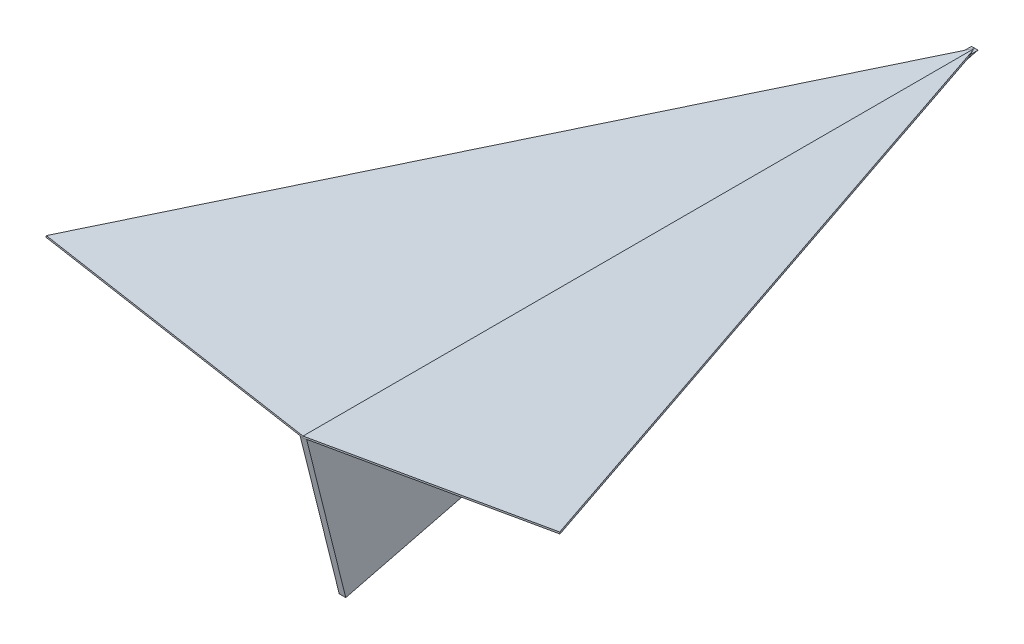
ISO-10303-21;
HEADER;
FILE_DESCRIPTION(('STEP AP214'),'2;1');
FILE_NAME('part.step','',(''),(''),'','','');
FILE_SCHEMA(('AUTOMOTIVE_DESIGN { 1 0 10303 214 1 1 1 1 }'));
ENDSEC;
DATA;
#1=APPLICATION_CONTEXT('core data for automotive mechanical design processes');
#2=APPLICATION_PROTOCOL_DEFINITION('international standard','automotive_design',2000,#1);
#3=PRODUCT_CONTEXT('',#1,'mechanical');
#4=PRODUCT('Part','Part','',(#3));
#5=PRODUCT_RELATED_PRODUCT_CATEGORY('part','',(#4));
#6=PRODUCT_DEFINITION_FORMATION('','',#4);
#7=PRODUCT_DEFINITION_CONTEXT('part definition',#1,'design');
#8=PRODUCT_DEFINITION('design','',#6,#7);
#9=PRODUCT_DEFINITION_SHAPE('','',#8);
#10=(LENGTH_UNIT() NAMED_UNIT(*) SI_UNIT(.MILLI.,.METRE.));
#11=(NAMED_UNIT(*) PLANE_ANGLE_UNIT() SI_UNIT($,.RADIAN.));
#12=(NAMED_UNIT(*) SI_UNIT($,.STERADIAN.) SOLID_ANGLE_UNIT());
#13=UNCERTAINTY_MEASURE_WITH_UNIT(LENGTH_MEASURE(1.E-05),#10,'distance_accuracy_value','');
#14=(GEOMETRIC_REPRESENTATION_CONTEXT(3) GLOBAL_UNCERTAINTY_ASSIGNED_CONTEXT((#13)) GLOBAL_UNIT_ASSIGNED_CONTEXT((#10,
#11,#12)) REPRESENTATION_CONTEXT('',''));
#15=CARTESIAN_POINT('',(0.,0.,0.));
#16=DIRECTION('',(0.,0.,1.));
#17=DIRECTION('',(1.,0.,0.));
#18=AXIS2_PLACEMENT_3D('',#15,#16,#17);
#19=CARTESIAN_POINT('',(0.,0.,0.));
#20=DIRECTION('',(-0.984807753012209,0.173648177666927,0.));
#21=DIRECTION('',(0.,0.,-1.));
#22=AXIS2_PLACEMENT_3D('',#19,#20,#21);
#23=PLANE('',#22);
#24=DIRECTION('',(-0.168613082024781,-0.95625230663687,-0.239063076659216));
#25=VECTOR('',#24,1.);
#26=CARTESIAN_POINT('',(-8.30994666202101,-47.1280494263135,194.373268924305));
#27=LINE('',#26,#25);
#28=CARTESIAN_POINT('',(0.,0.,206.155281280883));
#29=VERTEX_POINT('',#28);
#30=CARTESIAN_POINT('',(-0.0868240888334648,-0.492403876506104,206.032180311757));
#31=VERTEX_POINT('',#30);
#32=EDGE_CURVE('E218',#29,#31,#27,.T.);
#33=ORIENTED_EDGE('',*,*,#32,.F.);
#34=DIRECTION('',(0.173648177666927,0.984807753012209,0.));
#35=VECTOR('',#34,1.);
#36=CARTESIAN_POINT('',(0.,0.,206.155281280883));
#37=LINE('',#36,#35);
#38=CARTESIAN_POINT('',(-0.0868240888334637,-0.492403876506104,206.155281280883));
#39=VERTEX_POINT('',#38);
#40=EDGE_CURVE('E243',#39,#29,#37,.T.);
#41=ORIENTED_EDGE('',*,*,#40,.F.);
#42=DIRECTION('',(0.,0.,1.));
#43=VECTOR('',#42,1.);
#44=CARTESIAN_POINT('',(-0.0868240888334637,-0.492403876506104,0.));
#45=LINE('',#44,#43);
#46=EDGE_CURVE('E234',#39,#31,#45,.F.);
#47=ORIENTED_EDGE('',*,*,#46,.T.);
#48=EDGE_LOOP('',(#33,#41,#47));
#49=FACE_BOUND('',#48,.T.);
#50=ADVANCED_FACE('F41',(#49),#23,.F.);
#51=CARTESIAN_POINT('',(0.,0.,206.155281280883));
#52=DIRECTION('',(0.,0.,-1.));
#53=DIRECTION('',(0.984807753012209,-0.173648177666927,0.));
#54=AXIS2_PLACEMENT_3D('',#51,#52,#53);
#55=PLANE('',#54);
#56=DIRECTION('',(0.173648177666927,0.984807753012209,0.));
#57=VECTOR('',#56,1.);
#58=CARTESIAN_POINT('',(-78.7846202409767,13.8918542133542,206.155281280883));
#59=LINE('',#58,#57);
#60=CARTESIAN_POINT('',(-78.8714443298102,13.3994503368481,206.155281280883));
#61=VERTEX_POINT('',#60);
#62=CARTESIAN_POINT('',(-78.7846202409767,13.8918542133542,206.155281280883));
#63=VERTEX_POINT('',#62);
#64=EDGE_CURVE('E246',#61,#63,#59,.T.);
#65=ORIENTED_EDGE('',*,*,#64,.F.);
#66=DIRECTION('',(0.984807753012209,-0.173648177666927,0.));
#67=VECTOR('',#66,1.);
#68=CARTESIAN_POINT('',(-0.0868240888334637,-0.492403876506104,206.155281280883));
#69=LINE('',#68,#67);
#70=EDGE_CURVE('E227',#61,#39,#69,.T.);
#71=ORIENTED_EDGE('',*,*,#70,.T.);
#72=ORIENTED_EDGE('',*,*,#40,.T.);
#73=DIRECTION('',(0.984807753012209,-0.173648177666927,0.));
#74=VECTOR('',#73,1.);
#75=CARTESIAN_POINT('',(0.,0.,206.155281280883));
#76=LINE('',#75,#74);
#77=EDGE_CURVE('E230',#63,#29,#76,.T.);
#78=ORIENTED_EDGE('',*,*,#77,.F.);
#79=EDGE_LOOP('',(#65,#71,#72,#78));
#80=FACE_BOUND('',#79,.T.);
#81=ADVANCED_FACE('F299',(#80),#55,.F.);
#82=CARTESIAN_POINT('',(-78.7846202409767,13.8918542133542,206.155281280883));
#83=DIRECTION('',(0.918103185896323,-0.161886362747918,0.361772505316908));
#84=DIRECTION('',(-0.356276368062741,0.0628211362782798,0.932266407416211));
#85=AXIS2_PLACEMENT_3D('',#82,#83,#84);
#86=PLANE('',#85);
#87=DIRECTION('',(0.366608286043351,0.,-0.930375389079245));
#88=VECTOR('',#87,1.);
#89=CARTESIAN_POINT('',(-80.9049109743354,0.,205.319794701171));
#90=LINE('',#89,#88);
#91=CARTESIAN_POINT('',(-1.,0.,2.53779149162283));
#92=VERTEX_POINT('',#91);
#93=CARTESIAN_POINT('',(0.,0.,0.));
#94=VERTEX_POINT('',#93);
#95=EDGE_CURVE('E221',#92,#94,#90,.T.);
#96=ORIENTED_EDGE('',*,*,#95,.F.);
#97=DIRECTION('',(0.,-0.912779904818423,-0.408451766258478));
#98=VECTOR('',#97,1.);
#99=CARTESIAN_POINT('',(-1.,87.4882458029073,41.6871289566736));
#100=LINE('',#99,#98);
#101=CARTESIAN_POINT('',(-0.999999999999903,-0.331386325234429,2.38950237050844));
#102=VERTEX_POINT('',#101);
#103=EDGE_CURVE('E206',#102,#92,#100,.F.);
#104=ORIENTED_EDGE('',*,*,#103,.F.);
#105=DIRECTION('',(-0.356276368062741,0.0628211362782798,0.932266407416211));
#106=VECTOR('',#105,1.);
#107=CARTESIAN_POINT('',(-78.8714443298102,13.3994503368481,206.155281280883));
#108=LINE('',#107,#106);
#109=EDGE_CURVE('E237',#102,#61,#108,.T.);
#110=ORIENTED_EDGE('',*,*,#109,.T.);
#111=ORIENTED_EDGE('',*,*,#64,.T.);
#112=DIRECTION('',(-0.356276368062741,0.0628211362782798,0.932266407416211));
#113=VECTOR('',#112,1.);
#114=CARTESIAN_POINT('',(-78.7846202409767,13.8918542133542,206.155281280883));
#115=LINE('',#114,#113);
#116=EDGE_CURVE('E226',#94,#63,#115,.T.);
#117=ORIENTED_EDGE('',*,*,#116,.F.);
#118=EDGE_LOOP('',(#96,#104,#110,#111,#117));
#119=FACE_BOUND('',#118,.T.);
#120=ADVANCED_FACE('F43',(#119),#86,.F.);
#121=CARTESIAN_POINT('',(0.,0.,0.));
#122=DIRECTION('',(-0.173648177666927,-0.984807753012209,0.));
#123=DIRECTION('',(0.984807753012209,-0.173648177666927,0.));
#124=AXIS2_PLACEMENT_3D('',#121,#122,#123);
#125=PLANE('',#124);
#126=DIRECTION('',(0.,0.,-1.));
#127=VECTOR('',#126,1.);
#128=CARTESIAN_POINT('',(0.,0.,0.));
#129=LINE('',#128,#127);
#130=EDGE_CURVE('E156',#29,#94,#129,.T.);
#131=ORIENTED_EDGE('',*,*,#130,.T.);
#132=ORIENTED_EDGE('',*,*,#116,.T.);
#133=ORIENTED_EDGE('',*,*,#77,.T.);
#134=EDGE_LOOP('',(#131,#132,#133));
#135=FACE_BOUND('',#134,.T.);
#136=ADVANCED_FACE('F281',(#135),#125,.F.);
#137=CARTESIAN_POINT('',(-0.0868240888334637,-0.492403876506104,0.));
#138=DIRECTION('',(-0.173648177666927,-0.984807753012209,0.));
#139=DIRECTION('',(0.984807753012209,-0.173648177666927,0.));
#140=AXIS2_PLACEMENT_3D('',#137,#138,#139);
#141=PLANE('',#140);
#142=DIRECTION('',(0.983881075519547,-0.173484779422556,-0.0433711948556388));
#143=VECTOR('',#142,1.);
#144=CARTESIAN_POINT('',(8.70500126785192,-2.04263989656653,205.644621306741));
#145=LINE('',#144,#143);
#146=CARTESIAN_POINT('',(-1.,-0.331386325234416,206.072434699574));
#147=VERTEX_POINT('',#146);
#148=EDGE_CURVE('E253',#31,#147,#145,.F.);
#149=ORIENTED_EDGE('',*,*,#148,.F.);
#150=ORIENTED_EDGE('',*,*,#46,.F.);
#151=ORIENTED_EDGE('',*,*,#70,.F.);
#152=ORIENTED_EDGE('',*,*,#109,.F.);
#153=DIRECTION('',(0.,0.,-1.));
#154=VECTOR('',#153,1.);
#155=CARTESIAN_POINT('',(-1.,-0.33138632523441,0.));
#156=LINE('',#155,#154);
#157=EDGE_CURVE('E248',#147,#102,#156,.T.);
#158=ORIENTED_EDGE('',*,*,#157,.F.);
#159=EDGE_LOOP('',(#149,#150,#151,#152,#158));
#160=FACE_BOUND('',#159,.T.);
#161=ADVANCED_FACE('F301',(#160),#141,.T.);
#162=CARTESIAN_POINT('',(0.,0.,0.));
#163=DIRECTION('',(0.,-1.,0.));
#164=DIRECTION('',(0.,0.,1.));
#165=AXIS2_PLACEMENT_3D('',#162,#163,#164);
#166=PLANE('',#165);
#167=DIRECTION('',(0.366608286043352,0.,0.930375389079245));
#168=VECTOR('',#167,1.);
#169=CARTESIAN_POINT('',(0.,0.,0.));
#170=LINE('',#169,#168);
#171=CARTESIAN_POINT('',(1.,0.,2.53779149162285));
#172=VERTEX_POINT('',#171);
#173=EDGE_CURVE('E162',#172,#94,#170,.F.);
#174=ORIENTED_EDGE('',*,*,#173,.F.);
#175=DIRECTION('',(0.,0.,1.));
#176=VECTOR('',#175,1.);
#177=CARTESIAN_POINT('',(1.,0.,0.));
#178=LINE('',#177,#176);
#179=CARTESIAN_POINT('',(1.,0.,0.));
#180=VERTEX_POINT('',#179);
#181=EDGE_CURVE('E190',#180,#172,#178,.T.);
#182=ORIENTED_EDGE('',*,*,#181,.F.);
#183=DIRECTION('',(1.,0.,0.));
#184=VECTOR('',#183,1.);
#185=CARTESIAN_POINT('',(0.,0.,0.));
#186=LINE('',#185,#184);
#187=EDGE_CURVE('E194',#94,#180,#186,.T.);
#188=ORIENTED_EDGE('',*,*,#187,.F.);
#189=EDGE_LOOP('',(#174,#182,#188));
#190=FACE_BOUND('',#189,.T.);
#191=ADVANCED_FACE('F268',(#190),#166,.F.);
#192=CARTESIAN_POINT('',(0.,0.,206.155281280883));
#193=DIRECTION('',(0.,0.242535625036332,-0.970142500145332));
#194=DIRECTION('',(0.,-0.970142500145332,-0.242535625036332));
#195=AXIS2_PLACEMENT_3D('',#192,#193,#194);
#196=PLANE('',#195);
#197=DIRECTION('',(-0.168613082024788,0.956252306636869,0.239063076659216));
#198=VECTOR('',#197,1.);
#199=CARTESIAN_POINT('',(0.,0.,206.155281280883));
#200=LINE('',#199,#198);
#201=CARTESIAN_POINT('',(0.086824088833467,-0.492403876506104,206.032180311757));
#202=VERTEX_POINT('',#201);
#203=EDGE_CURVE('E177',#29,#202,#200,.F.);
#204=ORIENTED_EDGE('',*,*,#203,.F.);
#205=ORIENTED_EDGE('',*,*,#32,.T.);
#206=ORIENTED_EDGE('',*,*,#148,.T.);
#207=DIRECTION('',(0.,-0.970142500145332,-0.242535625036332));
#208=VECTOR('',#207,1.);
#209=CARTESIAN_POINT('',(-1.,0.,206.155281280883));
#210=LINE('',#209,#208);
#211=CARTESIAN_POINT('',(-1.,-48.5071250072666,194.028500029066));
#212=VERTEX_POINT('',#211);
#213=EDGE_CURVE('E191',#147,#212,#210,.T.);
#214=ORIENTED_EDGE('',*,*,#213,.T.);
#215=DIRECTION('',(1.,0.,0.));
#216=VECTOR('',#215,1.);
#217=CARTESIAN_POINT('',(0.,-48.5071250072666,194.028500029066));
#218=LINE('',#217,#216);
#219=CARTESIAN_POINT('',(1.,-48.5071250072666,194.028500029066));
#220=VERTEX_POINT('',#219);
#221=EDGE_CURVE('E203',#212,#220,#218,.T.);
#222=ORIENTED_EDGE('',*,*,#221,.T.);
#223=DIRECTION('',(0.,-0.970142500145332,-0.242535625036332));
#224=VECTOR('',#223,1.);
#225=CARTESIAN_POINT('',(1.,0.,206.155281280883));
#226=LINE('',#225,#224);
#227=CARTESIAN_POINT('',(1.,-0.331386325234406,206.072434699574));
#228=VERTEX_POINT('',#227);
#229=EDGE_CURVE('E192',#228,#220,#226,.T.);
#230=ORIENTED_EDGE('',*,*,#229,.F.);
#231=DIRECTION('',(0.983881075519546,0.173484779422562,0.0433711948556404));
#232=VECTOR('',#231,1.);
#233=CARTESIAN_POINT('',(0.0920770654323727,-0.491477635002686,206.032411872132));
#234=LINE('',#233,#232);
#235=EDGE_CURVE('E64',#228,#202,#234,.F.);
#236=ORIENTED_EDGE('',*,*,#235,.T.);
#237=EDGE_LOOP('',(#204,#205,#206,#214,#222,#230,#236));
#238=FACE_BOUND('',#237,.T.);
#239=ADVANCED_FACE('F304',(#238),#196,.F.);
#240=CARTESIAN_POINT('',(0.,-48.5071250072666,194.028500029066));
#241=DIRECTION('',(0.,0.970142500145332,0.242535625036333));
#242=DIRECTION('',(0.,0.242535625036333,-0.970142500145332));
#243=AXIS2_PLACEMENT_3D('',#240,#241,#242);
#244=PLANE('',#243);
#245=DIRECTION('',(-0.391174804997672,0.2232095127552,-0.892838051020799));
#246=VECTOR('',#245,1.);
#247=CARTESIAN_POINT('',(72.0009174838218,-41.0846749436913,164.338699774765));
#248=LINE('',#247,#246);
#249=CARTESIAN_POINT('',(0.679724172658984,-0.387859594863354,1.55143837945337));
#250=VERTEX_POINT('',#249);
#251=EDGE_CURVE('E184',#94,#250,#248,.F.);
#252=ORIENTED_EDGE('',*,*,#251,.F.);
#253=ORIENTED_EDGE('',*,*,#187,.T.);
#254=DIRECTION('',(0.,0.242535625036333,-0.970142500145332));
#255=VECTOR('',#254,1.);
#256=CARTESIAN_POINT('',(1.,-48.5071250072666,194.028500029066));
#257=LINE('',#256,#255);
#258=EDGE_CURVE('E187',#220,#180,#257,.T.);
#259=ORIENTED_EDGE('',*,*,#258,.F.);
#260=ORIENTED_EDGE('',*,*,#221,.F.);
#261=DIRECTION('',(0.,0.242535625036333,-0.970142500145332));
#262=VECTOR('',#261,1.);
#263=CARTESIAN_POINT('',(-1.,-48.5071250072666,194.028500029066));
#264=LINE('',#263,#262);
#265=CARTESIAN_POINT('',(-1.,0.,0.));
#266=VERTEX_POINT('',#265);
#267=EDGE_CURVE('E186',#212,#266,#264,.T.);
#268=ORIENTED_EDGE('',*,*,#267,.T.);
#269=EDGE_CURVE('E207',#266,#94,#186,.T.);
#270=ORIENTED_EDGE('',*,*,#269,.T.);
#271=DIRECTION('',(-0.391174804997671,-0.2232095127552,0.8928380510208));
#272=VECTOR('',#271,1.);
#273=CARTESIAN_POINT('',(-82.8434085872676,-47.2715436410943,189.086174564377));
#274=LINE('',#273,#272);
#275=CARTESIAN_POINT('',(-0.679724172659017,-0.387859594863353,1.55143837945339));
#276=VERTEX_POINT('',#275);
#277=EDGE_CURVE('E212',#94,#276,#274,.T.);
#278=ORIENTED_EDGE('',*,*,#277,.T.);
#279=DIRECTION('',(-0.808835321616389,0.142619490150976,-0.570477960603903));
#280=VECTOR('',#279,1.);
#281=CARTESIAN_POINT('',(-0.995649442313647,-0.332153445935643,1.32861378374259));
#282=LINE('',#281,#280);
#283=CARTESIAN_POINT('',(-0.0868240888334637,-0.492403876506104,1.96961550602443));
#284=VERTEX_POINT('',#283);
#285=EDGE_CURVE('E256',#276,#284,#282,.F.);
#286=ORIENTED_EDGE('',*,*,#285,.T.);
#287=DIRECTION('',(0.0427265211780192,0.242314142772416,-0.969256571089664));
#288=VECTOR('',#287,1.);
#289=CARTESIAN_POINT('',(0.,0.,0.));
#290=LINE('',#289,#288);
#291=EDGE_CURVE('E215',#284,#94,#290,.T.);
#292=ORIENTED_EDGE('',*,*,#291,.T.);
#293=DIRECTION('',(0.0427265211780209,-0.242314142772416,0.969256571089664));
#294=VECTOR('',#293,1.);
#295=CARTESIAN_POINT('',(8.53750070848244,-48.4185725529888,193.674290211955));
#296=LINE('',#295,#294);
#297=CARTESIAN_POINT('',(0.0868240888334534,-0.492403876506108,1.96961550602446));
#298=VERTEX_POINT('',#297);
#299=EDGE_CURVE('E148',#298,#94,#296,.F.);
#300=ORIENTED_EDGE('',*,*,#299,.F.);
#301=DIRECTION('',(-0.808835321616378,-0.142619490150979,0.570477960603917));
#302=VECTOR('',#301,1.);
#303=CARTESIAN_POINT('',(-94.1290821658783,-17.1052101611116,68.4208406444463));
#304=LINE('',#303,#302);
#305=EDGE_CURVE('E180',#298,#250,#304,.F.);
#306=ORIENTED_EDGE('',*,*,#305,.T.);
#307=EDGE_LOOP('',(#252,#253,#259,#260,#268,#270,#278,#286,#292,#300,#306));
#308=FACE_BOUND('',#307,.T.);
#309=ADVANCED_FACE('F287',(#308),#244,.F.);
#310=DIRECTION('',(0.,0.,1.));
#311=VECTOR('',#310,1.);
#312=CARTESIAN_POINT('',(-1.,0.,0.));
#313=LINE('',#312,#311);
#314=EDGE_CURVE('E199',#266,#92,#313,.T.);
#315=ORIENTED_EDGE('',*,*,#314,.T.);
#316=ORIENTED_EDGE('',*,*,#95,.T.);
#317=ORIENTED_EDGE('',*,*,#269,.F.);
#318=EDGE_LOOP('',(#315,#316,#317));
#319=FACE_BOUND('',#318,.T.);
#320=ADVANCED_FACE('F289',(#319),#166,.F.);
#321=CARTESIAN_POINT('',(1.,0.,0.));
#322=DIRECTION('',(-1.,0.,0.));
#323=DIRECTION('',(0.,0.,1.));
#324=AXIS2_PLACEMENT_3D('',#321,#322,#323);
#325=PLANE('',#324);
#326=ORIENTED_EDGE('',*,*,#181,.T.);
#327=DIRECTION('',(0.,-0.912779904818418,-0.408451766258491));
#328=VECTOR('',#327,1.);
#329=CARTESIAN_POINT('',(1.,-0.946156082803438,2.11440451614582));
#330=LINE('',#329,#328);
#331=CARTESIAN_POINT('',(0.999999999999994,-0.331386325234404,2.38950237050897));
#332=VERTEX_POINT('',#331);
#333=EDGE_CURVE('E11',#172,#332,#330,.T.);
#334=ORIENTED_EDGE('',*,*,#333,.T.);
#335=DIRECTION('',(0.,0.,-1.));
#336=VECTOR('',#335,1.);
#337=CARTESIAN_POINT('',(1.,-0.331386325234404,0.));
#338=LINE('',#337,#336);
#339=EDGE_CURVE('E49',#228,#332,#338,.T.);
#340=ORIENTED_EDGE('',*,*,#339,.F.);
#341=ORIENTED_EDGE('',*,*,#229,.T.);
#342=ORIENTED_EDGE('',*,*,#258,.T.);
#343=EDGE_LOOP('',(#326,#334,#340,#341,#342));
#344=FACE_BOUND('',#343,.T.);
#345=ADVANCED_FACE('F263',(#344),#325,.F.);
#346=CARTESIAN_POINT('',(-1.,0.,0.));
#347=DIRECTION('',(-1.,0.,0.));
#348=DIRECTION('',(0.,0.,1.));
#349=AXIS2_PLACEMENT_3D('',#346,#347,#348);
#350=PLANE('',#349);
#351=ORIENTED_EDGE('',*,*,#157,.T.);
#352=ORIENTED_EDGE('',*,*,#103,.T.);
#353=ORIENTED_EDGE('',*,*,#314,.F.);
#354=ORIENTED_EDGE('',*,*,#267,.F.);
#355=ORIENTED_EDGE('',*,*,#213,.F.);
#356=EDGE_LOOP('',(#351,#352,#353,#354,#355));
#357=FACE_BOUND('',#356,.T.);
#358=ADVANCED_FACE('F295',(#357),#350,.T.);
#359=ORIENTED_EDGE('',*,*,#285,.F.);
#360=CARTESIAN_POINT('',(-0.0868240888334637,-0.492403876506104,0.));
#361=VERTEX_POINT('',#360);
#362=EDGE_CURVE('E240',#361,#276,#108,.T.);
#363=ORIENTED_EDGE('',*,*,#362,.F.);
#364=EDGE_CURVE('E224',#284,#361,#45,.F.);
#365=ORIENTED_EDGE('',*,*,#364,.F.);
#366=EDGE_LOOP('',(#359,#363,#365));
#367=FACE_BOUND('',#366,.T.);
#368=ADVANCED_FACE('F331',(#367),#141,.T.);
#369=ORIENTED_EDGE('',*,*,#277,.F.);
#370=DIRECTION('',(0.173648177666927,0.984807753012209,0.));
#371=VECTOR('',#370,1.);
#372=CARTESIAN_POINT('',(0.,0.,0.));
#373=LINE('',#372,#371);
#374=EDGE_CURVE('E233',#361,#94,#373,.T.);
#375=ORIENTED_EDGE('',*,*,#374,.F.);
#376=ORIENTED_EDGE('',*,*,#362,.T.);
#377=EDGE_LOOP('',(#369,#375,#376));
#378=FACE_BOUND('',#377,.T.);
#379=ADVANCED_FACE('F274',(#378),#86,.F.);
#380=ORIENTED_EDGE('',*,*,#291,.F.);
#381=ORIENTED_EDGE('',*,*,#364,.T.);
#382=ORIENTED_EDGE('',*,*,#374,.T.);
#383=EDGE_LOOP('',(#380,#381,#382));
#384=FACE_BOUND('',#383,.T.);
#385=ADVANCED_FACE('F277',(#384),#23,.F.);
#386=CARTESIAN_POINT('',(0.086824088833467,-0.492403876506104,0.));
#387=DIRECTION('',(-0.173648177666934,0.984807753012208,0.));
#388=DIRECTION('',(-0.984807753012208,-0.173648177666934,0.));
#389=AXIS2_PLACEMENT_3D('',#386,#387,#388);
#390=PLANE('',#389);
#391=ORIENTED_EDGE('',*,*,#235,.F.);
#392=ORIENTED_EDGE('',*,*,#339,.T.);
#393=DIRECTION('',(-0.356276368062741,-0.0628211362782822,-0.932266407416211));
#394=VECTOR('',#393,1.);
#395=CARTESIAN_POINT('',(78.8714443298101,13.3994503368486,206.155281280883));
#396=LINE('',#395,#394);
#397=CARTESIAN_POINT('',(78.8714443298101,13.3994503368486,206.155281280883));
#398=VERTEX_POINT('',#397);
#399=EDGE_CURVE('E157',#398,#332,#396,.T.);
#400=ORIENTED_EDGE('',*,*,#399,.F.);
#401=DIRECTION('',(-0.984807753012208,-0.173648177666934,0.));
#402=VECTOR('',#401,1.);
#403=CARTESIAN_POINT('',(0.086824088833467,-0.492403876506104,206.155281280883));
#404=LINE('',#403,#402);
#405=CARTESIAN_POINT('',(0.086824088833467,-0.492403876506104,206.155281280883));
#406=VERTEX_POINT('',#405);
#407=EDGE_CURVE('E143',#406,#398,#404,.F.);
#408=ORIENTED_EDGE('',*,*,#407,.F.);
#409=DIRECTION('',(0.,0.,1.));
#410=VECTOR('',#409,1.);
#411=CARTESIAN_POINT('',(0.086824088833467,-0.492403876506104,0.));
#412=LINE('',#411,#410);
#413=EDGE_CURVE('E171',#202,#406,#412,.T.);
#414=ORIENTED_EDGE('',*,*,#413,.F.);
#415=EDGE_LOOP('',(#391,#392,#400,#408,#414));
#416=FACE_BOUND('',#415,.T.);
#417=ADVANCED_FACE('F260',(#416),#390,.F.);
#418=CARTESIAN_POINT('',(0.,0.,0.));
#419=DIRECTION('',(-0.173648177666934,0.984807753012208,0.));
#420=DIRECTION('',(-0.984807753012208,-0.173648177666934,0.));
#421=AXIS2_PLACEMENT_3D('',#418,#419,#420);
#422=PLANE('',#421);
#423=ORIENTED_EDGE('',*,*,#130,.F.);
#424=DIRECTION('',(0.984807753012208,0.173648177666934,0.));
#425=VECTOR('',#424,1.);
#426=CARTESIAN_POINT('',(0.,0.,206.155281280883));
#427=LINE('',#426,#425);
#428=CARTESIAN_POINT('',(78.7846202409766,13.8918542133547,206.155281280883));
#429=VERTEX_POINT('',#428);
#430=EDGE_CURVE('E141',#29,#429,#427,.T.);
#431=ORIENTED_EDGE('',*,*,#430,.T.);
#432=DIRECTION('',(-0.356276368062741,-0.0628211362782822,-0.932266407416211));
#433=VECTOR('',#432,1.);
#434=CARTESIAN_POINT('',(78.7846202409766,13.8918542133547,206.155281280883));
#435=LINE('',#434,#433);
#436=EDGE_CURVE('E154',#429,#94,#435,.T.);
#437=ORIENTED_EDGE('',*,*,#436,.T.);
#438=EDGE_LOOP('',(#423,#431,#437));
#439=FACE_BOUND('',#438,.T.);
#440=ADVANCED_FACE('F153',(#439),#422,.T.);
#441=CARTESIAN_POINT('',(0.,0.,206.155281280883));
#442=DIRECTION('',(0.,0.,1.));
#443=DIRECTION('',(0.984807753012208,0.173648177666934,0.));
#444=AXIS2_PLACEMENT_3D('',#441,#442,#443);
#445=PLANE('',#444);
#446=ORIENTED_EDGE('',*,*,#430,.F.);
#447=DIRECTION('',(-0.173648177666934,0.984807753012208,0.));
#448=VECTOR('',#447,1.);
#449=CARTESIAN_POINT('',(0.,0.,206.155281280883));
#450=LINE('',#449,#448);
#451=EDGE_CURVE('E163',#406,#29,#450,.T.);
#452=ORIENTED_EDGE('',*,*,#451,.F.);
#453=ORIENTED_EDGE('',*,*,#407,.T.);
#454=DIRECTION('',(-0.173648177666934,0.984807753012208,0.));
#455=VECTOR('',#454,1.);
#456=CARTESIAN_POINT('',(78.7846202409766,13.8918542133547,206.155281280883));
#457=LINE('',#456,#455);
#458=EDGE_CURVE('E137',#398,#429,#457,.T.);
#459=ORIENTED_EDGE('',*,*,#458,.T.);
#460=EDGE_LOOP('',(#446,#452,#453,#459));
#461=FACE_BOUND('',#460,.T.);
#462=ADVANCED_FACE('F139',(#461),#445,.T.);
#463=CARTESIAN_POINT('',(78.7846202409766,13.8918542133547,206.155281280883));
#464=DIRECTION('',(0.918103185896322,0.161886362747924,-0.361772505316908));
#465=DIRECTION('',(-0.356276368062741,-0.0628211362782822,-0.932266407416211));
#466=AXIS2_PLACEMENT_3D('',#463,#464,#465);
#467=PLANE('',#466);
#468=ORIENTED_EDGE('',*,*,#333,.F.);
#469=ORIENTED_EDGE('',*,*,#173,.T.);
#470=ORIENTED_EDGE('',*,*,#436,.F.);
#471=ORIENTED_EDGE('',*,*,#458,.F.);
#472=ORIENTED_EDGE('',*,*,#399,.T.);
#473=EDGE_LOOP('',(#468,#469,#470,#471,#472));
#474=FACE_BOUND('',#473,.T.);
#475=ADVANCED_FACE('F161',(#474),#467,.T.);
#476=CARTESIAN_POINT('',(0.,0.,0.));
#477=DIRECTION('',(-0.984807753012208,-0.173648177666934,0.));
#478=DIRECTION('',(0.,0.,1.));
#479=AXIS2_PLACEMENT_3D('',#476,#477,#478);
#480=PLANE('',#479);
#481=ORIENTED_EDGE('',*,*,#451,.T.);
#482=ORIENTED_EDGE('',*,*,#203,.T.);
#483=ORIENTED_EDGE('',*,*,#413,.T.);
#484=EDGE_LOOP('',(#481,#482,#483));
#485=FACE_BOUND('',#484,.T.);
#486=ADVANCED_FACE('F306',(#485),#480,.T.);
#487=DIRECTION('',(-0.173648177666934,0.984807753012208,0.));
#488=VECTOR('',#487,1.);
#489=CARTESIAN_POINT('',(0.,0.,0.));
#490=LINE('',#489,#488);
#491=CARTESIAN_POINT('',(0.086824088833467,-0.492403876506104,0.));
#492=VERTEX_POINT('',#491);
#493=EDGE_CURVE('E56',#492,#94,#490,.T.);
#494=ORIENTED_EDGE('',*,*,#493,.T.);
#495=ORIENTED_EDGE('',*,*,#251,.T.);
#496=EDGE_CURVE('E173',#250,#492,#396,.T.);
#497=ORIENTED_EDGE('',*,*,#496,.T.);
#498=EDGE_LOOP('',(#494,#495,#497));
#499=FACE_BOUND('',#498,.T.);
#500=ADVANCED_FACE('F308',(#499),#467,.T.);
#501=ORIENTED_EDGE('',*,*,#305,.F.);
#502=EDGE_CURVE('E168',#492,#298,#412,.T.);
#503=ORIENTED_EDGE('',*,*,#502,.F.);
#504=ORIENTED_EDGE('',*,*,#496,.F.);
#505=EDGE_LOOP('',(#501,#503,#504));
#506=FACE_BOUND('',#505,.T.);
#507=ADVANCED_FACE('F315',(#506),#390,.F.);
#508=ORIENTED_EDGE('',*,*,#502,.T.);
#509=ORIENTED_EDGE('',*,*,#299,.T.);
#510=ORIENTED_EDGE('',*,*,#493,.F.);
#511=EDGE_LOOP('',(#508,#509,#510));
#512=FACE_BOUND('',#511,.T.);
#513=ADVANCED_FACE('F310',(#512),#480,.T.);
#514=CLOSED_SHELL('',(#50,#81,#120,#136,#161,#191,#239,#309,#320,#345,#358,#368,#379,#385,#417,
#440,#462,#475,#486,#500,#507,#513));
#515=MANIFOLD_SOLID_BREP('B2',#514);
#516=ADVANCED_BREP_SHAPE_REPRESENTATION('',(#18,#515),#14);
#517=SHAPE_DEFINITION_REPRESENTATION(#9,#516);
ENDSEC;
END-ISO-10303-21;
